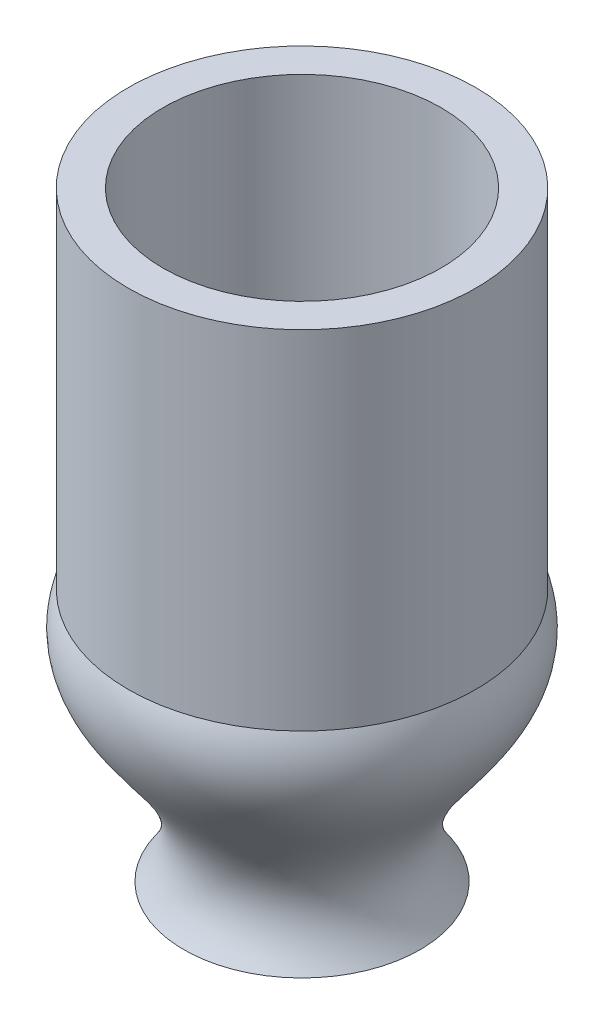
ISO-10303-21;
HEADER;
FILE_DESCRIPTION(('STEP AP214'),'2;1');
FILE_NAME('part.step','',(''),(''),'','','');
FILE_SCHEMA(('AUTOMOTIVE_DESIGN { 1 0 10303 214 1 1 1 1 }'));
ENDSEC;
DATA;
#1=APPLICATION_CONTEXT('core data for automotive mechanical design processes');
#2=APPLICATION_PROTOCOL_DEFINITION('international standard','automotive_design',2000,#1);
#3=PRODUCT_CONTEXT('',#1,'mechanical');
#4=PRODUCT('Part','Part','',(#3));
#5=PRODUCT_RELATED_PRODUCT_CATEGORY('part','',(#4));
#6=PRODUCT_DEFINITION_FORMATION('','',#4);
#7=PRODUCT_DEFINITION_CONTEXT('part definition',#1,'design');
#8=PRODUCT_DEFINITION('design','',#6,#7);
#9=PRODUCT_DEFINITION_SHAPE('','',#8);
#10=(LENGTH_UNIT() NAMED_UNIT(*) SI_UNIT(.MILLI.,.METRE.));
#11=(NAMED_UNIT(*) PLANE_ANGLE_UNIT() SI_UNIT($,.RADIAN.));
#12=(NAMED_UNIT(*) SI_UNIT($,.STERADIAN.) SOLID_ANGLE_UNIT());
#13=UNCERTAINTY_MEASURE_WITH_UNIT(LENGTH_MEASURE(1.E-05),#10,'distance_accuracy_value','');
#14=(GEOMETRIC_REPRESENTATION_CONTEXT(3) GLOBAL_UNCERTAINTY_ASSIGNED_CONTEXT((#13)) GLOBAL_UNIT_ASSIGNED_CONTEXT((#10,
#11,#12)) REPRESENTATION_CONTEXT('',''));
#15=CARTESIAN_POINT('',(0.,0.,0.));
#16=DIRECTION('',(0.,0.,1.));
#17=DIRECTION('',(1.,0.,0.));
#18=AXIS2_PLACEMENT_3D('',#15,#16,#17);
#19=CARTESIAN_POINT('',(24.7638863779704,-6.26006859767753,0.));
#20=CARTESIAN_POINT('',(14.0957162226153,8.03234428288139,0.));
#21=CARTESIAN_POINT('',(38.8499737357954,14.960293311712,0.));
#22=CARTESIAN_POINT('',(32.7638863779704,30.1621494882119,0.));
#23=B_SPLINE_CURVE_WITH_KNOTS('',3,(#19,#20,#21,#22),.UNSPECIFIED.,.F.,.F.,(4,4),(0.,1.),.UNSPECIFIED.);
#24=CARTESIAN_POINT('',(7.76388637797039,-6.26006859767753,0.));
#25=DIRECTION('',(0.,-1.,0.));
#26=AXIS1_PLACEMENT('',#24,#25);
#27=SURFACE_OF_REVOLUTION('',#23,#26);
#28=CARTESIAN_POINT('',(7.76388637797039,30.1621494882119,0.));
#29=DIRECTION('',(0.,-1.,0.));
#30=DIRECTION('',(0.,0.,-1.));
#31=AXIS2_PLACEMENT_3D('',#28,#29,#30);
#32=CIRCLE('',#31,25.);
#33=CARTESIAN_POINT('',(7.76388637797039,30.1621494882119,-25.));
#34=VERTEX_POINT('',#33);
#35=EDGE_CURVE('E10',#34,#34,#32,.T.);
#36=ORIENTED_EDGE('',*,*,#35,.T.);
#37=EDGE_LOOP('',(#36));
#38=FACE_BOUND('',#37,.T.);
#39=CARTESIAN_POINT('',(7.76388637797039,-6.26006859767753,0.));
#40=DIRECTION('',(0.,-1.,0.));
#41=DIRECTION('',(0.,0.,-1.));
#42=AXIS2_PLACEMENT_3D('',#39,#40,#41);
#43=CIRCLE('',#42,17.);
#44=CARTESIAN_POINT('',(7.76388637797039,-6.26006859767753,-17.));
#45=VERTEX_POINT('',#44);
#46=EDGE_CURVE('E71',#45,#45,#43,.T.);
#47=ORIENTED_EDGE('',*,*,#46,.F.);
#48=EDGE_LOOP('',(#47));
#49=FACE_BOUND('',#48,.T.);
#50=ADVANCED_FACE('F43',(#38,#49),#27,.F.);
#51=CARTESIAN_POINT('',(7.76388637797039,-6.26006859767753,0.));
#52=DIRECTION('',(0.,-1.,0.));
#53=DIRECTION('',(0.,0.,-1.));
#54=AXIS2_PLACEMENT_3D('',#51,#52,#53);
#55=CYLINDRICAL_SURFACE('',#54,25.);
#56=CARTESIAN_POINT('',(7.76388637797039,80.1621494882119,0.));
#57=DIRECTION('',(0.,-1.,0.));
#58=DIRECTION('',(0.,0.,-1.));
#59=AXIS2_PLACEMENT_3D('',#56,#57,#58);
#60=CIRCLE('',#59,25.);
#61=CARTESIAN_POINT('',(7.76388637797039,80.1621494882119,-25.));
#62=VERTEX_POINT('',#61);
#63=EDGE_CURVE('E51',#62,#62,#60,.T.);
#64=ORIENTED_EDGE('',*,*,#63,.T.);
#65=EDGE_LOOP('',(#64));
#66=FACE_BOUND('',#65,.T.);
#67=ORIENTED_EDGE('',*,*,#35,.F.);
#68=EDGE_LOOP('',(#67));
#69=FACE_BOUND('',#68,.T.);
#70=ADVANCED_FACE('F97',(#66,#69),#55,.T.);
#71=CARTESIAN_POINT('',(32.7638863779704,80.1621494882119,0.));
#72=DIRECTION('',(0.,1.,0.));
#73=DIRECTION('',(0.,0.,1.));
#74=AXIS2_PLACEMENT_3D('',#71,#72,#73);
#75=PLANE('',#74);
#76=CARTESIAN_POINT('',(7.76388637797039,80.1621494882119,0.));
#77=DIRECTION('',(0.,-1.,0.));
#78=DIRECTION('',(0.,0.,-1.));
#79=AXIS2_PLACEMENT_3D('',#76,#77,#78);
#80=CIRCLE('',#79,20.);
#81=CARTESIAN_POINT('',(7.76388637797039,80.1621494882119,-20.));
#82=VERTEX_POINT('',#81);
#83=EDGE_CURVE('E56',#82,#82,#80,.T.);
#84=ORIENTED_EDGE('',*,*,#83,.T.);
#85=EDGE_LOOP('',(#84));
#86=FACE_BOUND('',#85,.T.);
#87=ORIENTED_EDGE('',*,*,#63,.F.);
#88=EDGE_LOOP('',(#87));
#89=FACE_BOUND('',#88,.T.);
#90=ADVANCED_FACE('F94',(#86,#89),#75,.T.);
#91=CARTESIAN_POINT('',(7.76388637797039,-6.26006859767753,0.));
#92=DIRECTION('',(0.,-1.,0.));
#93=DIRECTION('',(0.,0.,-1.));
#94=AXIS2_PLACEMENT_3D('',#91,#92,#93);
#95=CYLINDRICAL_SURFACE('',#94,20.);
#96=CARTESIAN_POINT('',(7.76388637797039,30.1621494882119,0.));
#97=DIRECTION('',(0.,-1.,0.));
#98=DIRECTION('',(0.,0.,-1.));
#99=AXIS2_PLACEMENT_3D('',#96,#97,#98);
#100=CIRCLE('',#99,20.);
#101=CARTESIAN_POINT('',(7.76388637797039,30.1621494882119,-20.));
#102=VERTEX_POINT('',#101);
#103=EDGE_CURVE('E61',#102,#102,#100,.T.);
#104=ORIENTED_EDGE('',*,*,#103,.T.);
#105=EDGE_LOOP('',(#104));
#106=FACE_BOUND('',#105,.T.);
#107=ORIENTED_EDGE('',*,*,#83,.F.);
#108=EDGE_LOOP('',(#107));
#109=FACE_BOUND('',#108,.T.);
#110=ADVANCED_FACE('F90',(#106,#109),#95,.F.);
#111=CARTESIAN_POINT('',(27.7638863779704,30.1621494882119,0.));
#112=CARTESIAN_POINT('',(31.8005998981244,15.4488041890622,0.));
#113=CARTESIAN_POINT('',(9.4717400977645,8.36090644870556,0.));
#114=CARTESIAN_POINT('',(19.7638863779704,-6.26006859767753,0.));
#115=B_SPLINE_CURVE_WITH_KNOTS('',3,(#111,#112,#113,#114),.UNSPECIFIED.,.F.,.F.,(4,4),(0.,1.),.UNSPECIFIED.);
#116=CARTESIAN_POINT('',(7.76388637797039,-6.26006859767753,0.));
#117=DIRECTION('',(0.,-1.,0.));
#118=AXIS1_PLACEMENT('',#116,#117);
#119=SURFACE_OF_REVOLUTION('',#115,#118);
#120=CARTESIAN_POINT('',(7.76388637797039,-6.26006859767753,0.));
#121=DIRECTION('',(0.,-1.,0.));
#122=DIRECTION('',(0.,0.,-1.));
#123=AXIS2_PLACEMENT_3D('',#120,#121,#122);
#124=CIRCLE('',#123,12.);
#125=CARTESIAN_POINT('',(7.76388637797039,-6.26006859767753,-12.));
#126=VERTEX_POINT('',#125);
#127=EDGE_CURVE('E67',#126,#126,#124,.T.);
#128=ORIENTED_EDGE('',*,*,#127,.T.);
#129=EDGE_LOOP('',(#128));
#130=FACE_BOUND('',#129,.T.);
#131=ORIENTED_EDGE('',*,*,#103,.F.);
#132=EDGE_LOOP('',(#131));
#133=FACE_BOUND('',#132,.T.);
#134=ADVANCED_FACE('F85',(#130,#133),#119,.F.);
#135=CARTESIAN_POINT('',(19.7638863779704,-6.26006859767753,0.));
#136=DIRECTION('',(0.,-1.,0.));
#137=DIRECTION('',(0.,0.,-1.));
#138=AXIS2_PLACEMENT_3D('',#135,#136,#137);
#139=PLANE('',#138);
#140=ORIENTED_EDGE('',*,*,#46,.T.);
#141=EDGE_LOOP('',(#140));
#142=FACE_BOUND('',#141,.T.);
#143=ORIENTED_EDGE('',*,*,#127,.F.);
#144=EDGE_LOOP('',(#143));
#145=FACE_BOUND('',#144,.T.);
#146=ADVANCED_FACE('F89',(#142,#145),#139,.T.);
#147=CLOSED_SHELL('',(#50,#70,#90,#110,#134,#146));
#148=MANIFOLD_SOLID_BREP('B2',#147);
#149=ADVANCED_BREP_SHAPE_REPRESENTATION('',(#18,#148),#14);
#150=SHAPE_DEFINITION_REPRESENTATION(#9,#149);
ENDSEC;
END-ISO-10303-21;
